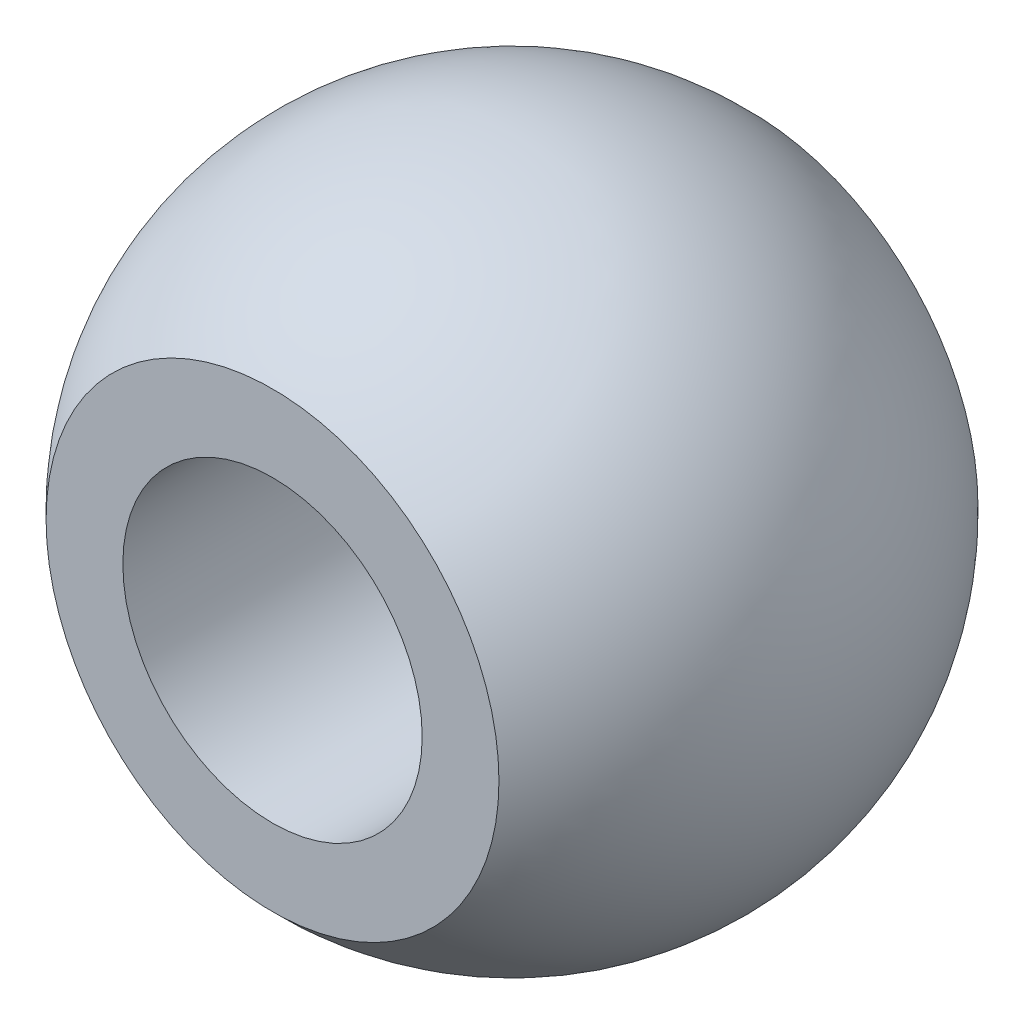
ISO-10303-21;
HEADER;
FILE_DESCRIPTION(('STEP AP214'),'2;1');
FILE_NAME('part.step','',(''),(''),'','','');
FILE_SCHEMA(('AUTOMOTIVE_DESIGN { 1 0 10303 214 1 1 1 1 }'));
ENDSEC;
DATA;
#1=APPLICATION_CONTEXT('core data for automotive mechanical design processes');
#2=APPLICATION_PROTOCOL_DEFINITION('international standard','automotive_design',2000,#1);
#3=PRODUCT_CONTEXT('',#1,'mechanical');
#4=PRODUCT('Part','Part','',(#3));
#5=PRODUCT_RELATED_PRODUCT_CATEGORY('part','',(#4));
#6=PRODUCT_DEFINITION_FORMATION('','',#4);
#7=PRODUCT_DEFINITION_CONTEXT('part definition',#1,'design');
#8=PRODUCT_DEFINITION('design','',#6,#7);
#9=PRODUCT_DEFINITION_SHAPE('','',#8);
#10=(LENGTH_UNIT() NAMED_UNIT(*) SI_UNIT(.MILLI.,.METRE.));
#11=(NAMED_UNIT(*) PLANE_ANGLE_UNIT() SI_UNIT($,.RADIAN.));
#12=(NAMED_UNIT(*) SI_UNIT($,.STERADIAN.) SOLID_ANGLE_UNIT());
#13=UNCERTAINTY_MEASURE_WITH_UNIT(LENGTH_MEASURE(1.E-05),#10,'distance_accuracy_value','');
#14=(GEOMETRIC_REPRESENTATION_CONTEXT(3) GLOBAL_UNCERTAINTY_ASSIGNED_CONTEXT((#13)) GLOBAL_UNIT_ASSIGNED_CONTEXT((#10,
#11,#12)) REPRESENTATION_CONTEXT('',''));
#15=CARTESIAN_POINT('',(0.,0.,0.));
#16=DIRECTION('',(0.,0.,1.));
#17=DIRECTION('',(1.,0.,0.));
#18=AXIS2_PLACEMENT_3D('',#15,#16,#17);
#19=CARTESIAN_POINT('',(0.,0.,0.));
#20=DIRECTION('',(0.,-1.,0.));
#21=DIRECTION('',(-1.,0.,0.));
#22=AXIS2_PLACEMENT_3D('',#19,#20,#21);
#23=SPHERICAL_SURFACE('',#22,5.505);
#24=CARTESIAN_POINT('',(0.,0.,0.));
#25=DIRECTION('',(0.,0.,1.));
#26=DIRECTION('',(1.,0.,0.));
#27=AXIS2_PLACEMENT_3D('',#24,#25,#26);
#28=SPHERICAL_SURFACE('',#27,5.505);
#29=CARTESIAN_POINT('',(0.,0.,-4.));
#30=DIRECTION('',(0.,0.,1.));
#31=DIRECTION('',(1.,0.,0.));
#32=AXIS2_PLACEMENT_3D('',#29,#30,#31);
#33=CIRCLE('',#32,3.78219843477309);
#34=CARTESIAN_POINT('',(3.78219843477309,0.,-4.));
#35=VERTEX_POINT('',#34);
#36=EDGE_CURVE('E42',#35,#35,#33,.F.);
#37=ORIENTED_EDGE('',*,*,#36,.F.);
#38=EDGE_LOOP('',(#37));
#39=FACE_BOUND('',#38,.T.);
#40=CARTESIAN_POINT('',(0.,0.,4.));
#41=DIRECTION('',(0.,0.,-1.));
#42=DIRECTION('',(-1.,0.,0.));
#43=AXIS2_PLACEMENT_3D('',#40,#41,#42);
#44=CIRCLE('',#43,3.78219843477309);
#45=CARTESIAN_POINT('',(-3.78219843477309,0.,4.));
#46=VERTEX_POINT('',#45);
#47=EDGE_CURVE('E10',#46,#46,#44,.F.);
#48=ORIENTED_EDGE('',*,*,#47,.F.);
#49=EDGE_LOOP('',(#48));
#50=FACE_BOUND('',#49,.T.);
#51=ADVANCED_FACE('F30',(#39,#50),#28,.T.);
#52=CARTESIAN_POINT('',(0.,0.,-5.505));
#53=DIRECTION('',(0.,0.,1.));
#54=DIRECTION('',(1.,0.,0.));
#55=AXIS2_PLACEMENT_3D('',#52,#53,#54);
#56=CYLINDRICAL_SURFACE('',#55,2.5);
#57=CARTESIAN_POINT('',(0.,0.,-4.));
#58=DIRECTION('',(0.,0.,1.));
#59=DIRECTION('',(1.,0.,0.));
#60=AXIS2_PLACEMENT_3D('',#57,#58,#59);
#61=CIRCLE('',#60,2.5);
#62=CARTESIAN_POINT('',(2.5,0.,-4.));
#63=VERTEX_POINT('',#62);
#64=EDGE_CURVE('E33',#63,#63,#61,.F.);
#65=ORIENTED_EDGE('',*,*,#64,.T.);
#66=EDGE_LOOP('',(#65));
#67=FACE_BOUND('',#66,.T.);
#68=CARTESIAN_POINT('',(0.,0.,4.));
#69=DIRECTION('',(0.,0.,-1.));
#70=DIRECTION('',(-1.,0.,0.));
#71=AXIS2_PLACEMENT_3D('',#68,#69,#70);
#72=CIRCLE('',#71,2.5);
#73=CARTESIAN_POINT('',(-2.5,0.,4.));
#74=VERTEX_POINT('',#73);
#75=EDGE_CURVE('E37',#74,#74,#72,.F.);
#76=ORIENTED_EDGE('',*,*,#75,.T.);
#77=EDGE_LOOP('',(#76));
#78=FACE_BOUND('',#77,.T.);
#79=ADVANCED_FACE('F50',(#67,#78),#56,.F.);
#80=CARTESIAN_POINT('',(0.,0.,4.));
#81=DIRECTION('',(0.,0.,-1.));
#82=DIRECTION('',(-1.,0.,0.));
#83=AXIS2_PLACEMENT_3D('',#80,#81,#82);
#84=PLANE('',#83);
#85=ORIENTED_EDGE('',*,*,#47,.T.);
#86=EDGE_LOOP('',(#85));
#87=FACE_BOUND('',#86,.T.);
#88=ORIENTED_EDGE('',*,*,#75,.F.);
#89=EDGE_LOOP('',(#88));
#90=FACE_BOUND('',#89,.T.);
#91=ADVANCED_FACE('F55',(#87,#90),#84,.F.);
#92=CARTESIAN_POINT('',(0.,0.,-4.));
#93=DIRECTION('',(0.,0.,1.));
#94=DIRECTION('',(-1.,0.,0.));
#95=AXIS2_PLACEMENT_3D('',#92,#93,#94);
#96=PLANE('',#95);
#97=ORIENTED_EDGE('',*,*,#36,.T.);
#98=EDGE_LOOP('',(#97));
#99=FACE_BOUND('',#98,.T.);
#100=ORIENTED_EDGE('',*,*,#64,.F.);
#101=EDGE_LOOP('',(#100));
#102=FACE_BOUND('',#101,.T.);
#103=ADVANCED_FACE('F53',(#99,#102),#96,.F.);
#104=CLOSED_SHELL('',(#51,#79,#91,#103));
#105=MANIFOLD_SOLID_BREP('B2',#104);
#106=ADVANCED_BREP_SHAPE_REPRESENTATION('',(#18,#105),#14);
#107=SHAPE_DEFINITION_REPRESENTATION(#9,#106);
ENDSEC;
END-ISO-10303-21;
